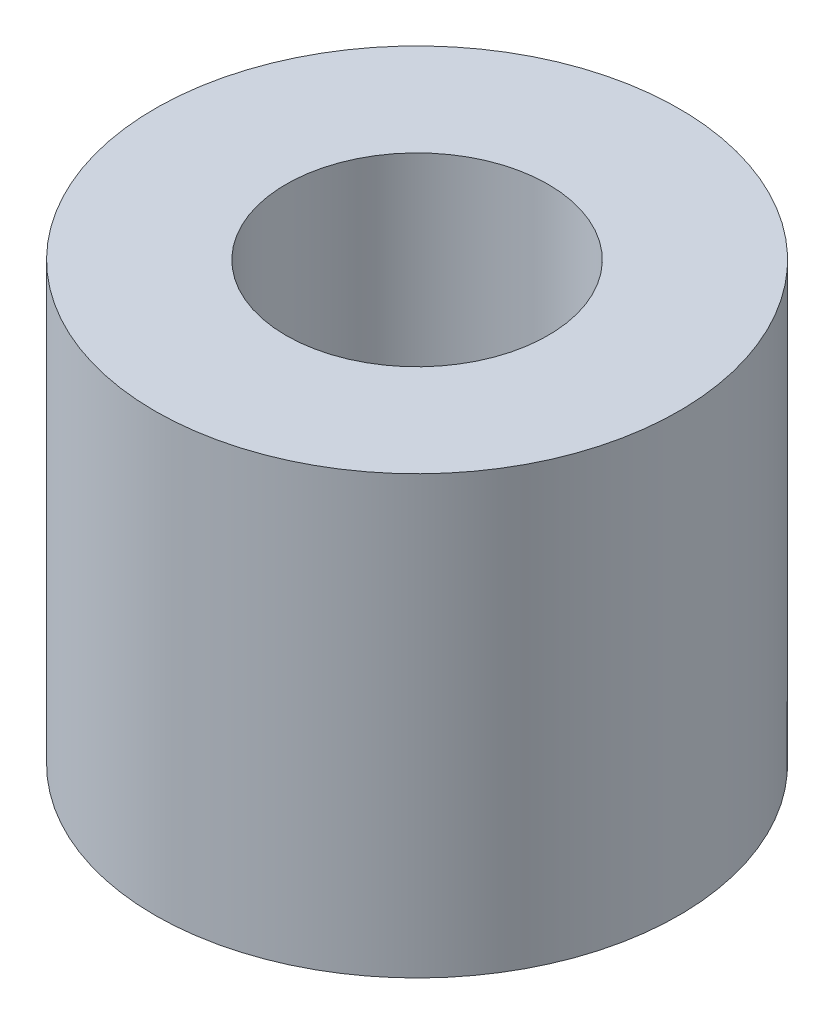
ISO-10303-21;
HEADER;
FILE_DESCRIPTION(('STEP AP214'),'2;1');
FILE_NAME('part.step','',(''),(''),'','','');
FILE_SCHEMA(('AUTOMOTIVE_DESIGN { 1 0 10303 214 1 1 1 1 }'));
ENDSEC;
DATA;
#1=APPLICATION_CONTEXT('core data for automotive mechanical design processes');
#2=APPLICATION_PROTOCOL_DEFINITION('international standard','automotive_design',2000,#1);
#3=PRODUCT_CONTEXT('',#1,'mechanical');
#4=PRODUCT('Part','Part','',(#3));
#5=PRODUCT_RELATED_PRODUCT_CATEGORY('part','',(#4));
#6=PRODUCT_DEFINITION_FORMATION('','',#4);
#7=PRODUCT_DEFINITION_CONTEXT('part definition',#1,'design');
#8=PRODUCT_DEFINITION('design','',#6,#7);
#9=PRODUCT_DEFINITION_SHAPE('','',#8);
#10=(LENGTH_UNIT() NAMED_UNIT(*) SI_UNIT(.MILLI.,.METRE.));
#11=(NAMED_UNIT(*) PLANE_ANGLE_UNIT() SI_UNIT($,.RADIAN.));
#12=(NAMED_UNIT(*) SI_UNIT($,.STERADIAN.) SOLID_ANGLE_UNIT());
#13=UNCERTAINTY_MEASURE_WITH_UNIT(LENGTH_MEASURE(1.E-05),#10,'distance_accuracy_value','');
#14=(GEOMETRIC_REPRESENTATION_CONTEXT(3) GLOBAL_UNCERTAINTY_ASSIGNED_CONTEXT((#13)) GLOBAL_UNIT_ASSIGNED_CONTEXT((#10,
#11,#12)) REPRESENTATION_CONTEXT('',''));
#15=CARTESIAN_POINT('',(0.,0.,0.));
#16=DIRECTION('',(0.,0.,1.));
#17=DIRECTION('',(1.,0.,0.));
#18=AXIS2_PLACEMENT_3D('',#15,#16,#17);
#19=CARTESIAN_POINT('',(0.,5.,0.));
#20=DIRECTION('',(0.,1.,0.));
#21=DIRECTION('',(0.,0.,1.));
#22=AXIS2_PLACEMENT_3D('',#19,#20,#21);
#23=PLANE('',#22);
#24=CARTESIAN_POINT('',(0.,5.,0.));
#25=DIRECTION('',(0.,1.,0.));
#26=DIRECTION('',(0.,0.,1.));
#27=AXIS2_PLACEMENT_3D('',#24,#25,#26);
#28=CIRCLE('',#27,3.);
#29=CARTESIAN_POINT('',(0.,5.,3.));
#30=VERTEX_POINT('',#29);
#31=EDGE_CURVE('E10',#30,#30,#28,.T.);
#32=ORIENTED_EDGE('',*,*,#31,.T.);
#33=EDGE_LOOP('',(#32));
#34=FACE_BOUND('',#33,.T.);
#35=CARTESIAN_POINT('',(0.,5.,0.));
#36=DIRECTION('',(0.,1.,0.));
#37=DIRECTION('',(0.,0.,1.));
#38=AXIS2_PLACEMENT_3D('',#35,#36,#37);
#39=CIRCLE('',#38,1.5);
#40=CARTESIAN_POINT('',(0.,5.,1.5));
#41=VERTEX_POINT('',#40);
#42=EDGE_CURVE('E41',#41,#41,#39,.T.);
#43=ORIENTED_EDGE('',*,*,#42,.F.);
#44=EDGE_LOOP('',(#43));
#45=FACE_BOUND('',#44,.T.);
#46=ADVANCED_FACE('F30',(#34,#45),#23,.T.);
#47=CARTESIAN_POINT('',(0.,0.,0.));
#48=DIRECTION('',(0.,1.,0.));
#49=DIRECTION('',(0.,0.,1.));
#50=AXIS2_PLACEMENT_3D('',#47,#48,#49);
#51=PLANE('',#50);
#52=CARTESIAN_POINT('',(0.,0.,0.));
#53=DIRECTION('',(0.,1.,0.));
#54=DIRECTION('',(0.,0.,1.));
#55=AXIS2_PLACEMENT_3D('',#52,#53,#54);
#56=CIRCLE('',#55,3.);
#57=CARTESIAN_POINT('',(0.,0.,3.));
#58=VERTEX_POINT('',#57);
#59=EDGE_CURVE('E34',#58,#58,#56,.T.);
#60=ORIENTED_EDGE('',*,*,#59,.F.);
#61=EDGE_LOOP('',(#60));
#62=FACE_BOUND('',#61,.T.);
#63=CARTESIAN_POINT('',(0.,0.,0.));
#64=DIRECTION('',(0.,1.,0.));
#65=DIRECTION('',(0.,0.,1.));
#66=AXIS2_PLACEMENT_3D('',#63,#64,#65);
#67=CIRCLE('',#66,1.5);
#68=CARTESIAN_POINT('',(0.,0.,1.5));
#69=VERTEX_POINT('',#68);
#70=EDGE_CURVE('E43',#69,#69,#67,.T.);
#71=ORIENTED_EDGE('',*,*,#70,.T.);
#72=EDGE_LOOP('',(#71));
#73=FACE_BOUND('',#72,.T.);
#74=ADVANCED_FACE('F53',(#62,#73),#51,.F.);
#75=CARTESIAN_POINT('',(0.,5.,0.));
#76=DIRECTION('',(0.,-1.,0.));
#77=DIRECTION('',(0.,0.,-1.));
#78=AXIS2_PLACEMENT_3D('',#75,#76,#77);
#79=CYLINDRICAL_SURFACE('',#78,3.);
#80=ORIENTED_EDGE('',*,*,#31,.F.);
#81=EDGE_LOOP('',(#80));
#82=FACE_BOUND('',#81,.T.);
#83=ORIENTED_EDGE('',*,*,#59,.T.);
#84=EDGE_LOOP('',(#83));
#85=FACE_BOUND('',#84,.T.);
#86=ADVANCED_FACE('F32',(#82,#85),#79,.T.);
#87=CARTESIAN_POINT('',(0.,5.,0.));
#88=DIRECTION('',(0.,-1.,0.));
#89=DIRECTION('',(0.,0.,-1.));
#90=AXIS2_PLACEMENT_3D('',#87,#88,#89);
#91=CYLINDRICAL_SURFACE('',#90,1.5);
#92=ORIENTED_EDGE('',*,*,#42,.T.);
#93=EDGE_LOOP('',(#92));
#94=FACE_BOUND('',#93,.T.);
#95=ORIENTED_EDGE('',*,*,#70,.F.);
#96=EDGE_LOOP('',(#95));
#97=FACE_BOUND('',#96,.T.);
#98=ADVANCED_FACE('F49',(#94,#97),#91,.F.);
#99=CLOSED_SHELL('',(#46,#74,#86,#98));
#100=MANIFOLD_SOLID_BREP('B2',#99);
#101=ADVANCED_BREP_SHAPE_REPRESENTATION('',(#18,#100),#14);
#102=SHAPE_DEFINITION_REPRESENTATION(#9,#101);
ENDSEC;
END-ISO-10303-21;
